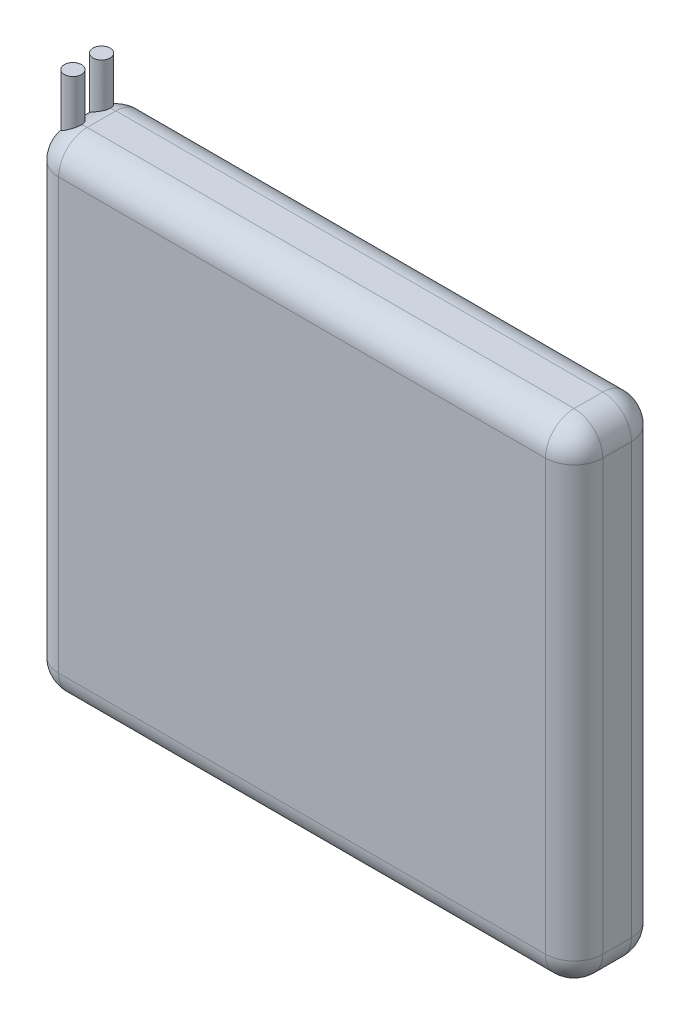
ISO-10303-21;
HEADER;
FILE_DESCRIPTION(('STEP AP214'),'2;1');
FILE_NAME('part.step','',(''),(''),'','','');
FILE_SCHEMA(('AUTOMOTIVE_DESIGN { 1 0 10303 214 1 1 1 1 }'));
ENDSEC;
DATA;
#1=APPLICATION_CONTEXT('core data for automotive mechanical design processes');
#2=APPLICATION_PROTOCOL_DEFINITION('international standard','automotive_design',2000,#1);
#3=PRODUCT_CONTEXT('',#1,'mechanical');
#4=PRODUCT('Part','Part','',(#3));
#5=PRODUCT_RELATED_PRODUCT_CATEGORY('part','',(#4));
#6=PRODUCT_DEFINITION_FORMATION('','',#4);
#7=PRODUCT_DEFINITION_CONTEXT('part definition',#1,'design');
#8=PRODUCT_DEFINITION('design','',#6,#7);
#9=PRODUCT_DEFINITION_SHAPE('','',#8);
#10=(LENGTH_UNIT() NAMED_UNIT(*) SI_UNIT(.MILLI.,.METRE.));
#11=(NAMED_UNIT(*) PLANE_ANGLE_UNIT() SI_UNIT($,.RADIAN.));
#12=(NAMED_UNIT(*) SI_UNIT($,.STERADIAN.) SOLID_ANGLE_UNIT());
#13=UNCERTAINTY_MEASURE_WITH_UNIT(LENGTH_MEASURE(1.E-05),#10,'distance_accuracy_value','');
#14=(GEOMETRIC_REPRESENTATION_CONTEXT(3) GLOBAL_UNCERTAINTY_ASSIGNED_CONTEXT((#13)) GLOBAL_UNIT_ASSIGNED_CONTEXT((#10,
#11,#12)) REPRESENTATION_CONTEXT('',''));
#15=CARTESIAN_POINT('',(0.,0.,0.));
#16=DIRECTION('',(0.,0.,1.));
#17=DIRECTION('',(1.,0.,0.));
#18=AXIS2_PLACEMENT_3D('',#15,#16,#17);
#19=CARTESIAN_POINT('',(0.,0.,6.));
#20=DIRECTION('',(1.,0.,0.));
#21=DIRECTION('',(0.,0.,-1.));
#22=AXIS2_PLACEMENT_3D('',#19,#20,#21);
#23=PLANE('',#22);
#24=DIRECTION('',(0.,-1.,0.));
#25=VECTOR('',#24,1.);
#26=CARTESIAN_POINT('',(0.,0.,4.));
#27=LINE('',#26,#25);
#28=CARTESIAN_POINT('',(0.,2.,4.));
#29=VERTEX_POINT('',#28);
#30=CARTESIAN_POINT('',(0.,32.,4.));
#31=VERTEX_POINT('',#30);
#32=EDGE_CURVE('E385',#29,#31,#27,.F.);
#33=ORIENTED_EDGE('',*,*,#32,.T.);
#34=DIRECTION('',(0.,0.,-1.));
#35=VECTOR('',#34,1.);
#36=CARTESIAN_POINT('',(0.,32.,6.));
#37=LINE('',#36,#35);
#38=CARTESIAN_POINT('',(0.,32.,2.));
#39=VERTEX_POINT('',#38);
#40=EDGE_CURVE('E387',#31,#39,#37,.T.);
#41=ORIENTED_EDGE('',*,*,#40,.T.);
#42=DIRECTION('',(0.,-1.,0.));
#43=VECTOR('',#42,1.);
#44=CARTESIAN_POINT('',(0.,0.,2.));
#45=LINE('',#44,#43);
#46=CARTESIAN_POINT('',(0.,2.,2.));
#47=VERTEX_POINT('',#46);
#48=EDGE_CURVE('E383',#39,#47,#45,.T.);
#49=ORIENTED_EDGE('',*,*,#48,.T.);
#50=DIRECTION('',(0.,0.,-1.));
#51=VECTOR('',#50,1.);
#52=CARTESIAN_POINT('',(0.,2.,6.));
#53=LINE('',#52,#51);
#54=EDGE_CURVE('E381',#47,#29,#53,.F.);
#55=ORIENTED_EDGE('',*,*,#54,.T.);
#56=EDGE_LOOP('',(#33,#41,#49,#55));
#57=FACE_BOUND('',#56,.T.);
#58=ADVANCED_FACE('F35',(#57),#23,.F.);
#59=CARTESIAN_POINT('',(0.,0.,6.));
#60=DIRECTION('',(0.,1.,0.));
#61=DIRECTION('',(0.,0.,1.));
#62=AXIS2_PLACEMENT_3D('',#59,#60,#61);
#63=PLANE('',#62);
#64=DIRECTION('',(1.,0.,0.));
#65=VECTOR('',#64,1.);
#66=CARTESIAN_POINT('',(0.,0.,4.));
#67=LINE('',#66,#65);
#68=CARTESIAN_POINT('',(36.,0.,4.));
#69=VERTEX_POINT('',#68);
#70=CARTESIAN_POINT('',(2.,0.,4.));
#71=VERTEX_POINT('',#70);
#72=EDGE_CURVE('E403',#69,#71,#67,.F.);
#73=ORIENTED_EDGE('',*,*,#72,.T.);
#74=DIRECTION('',(0.,0.,-1.));
#75=VECTOR('',#74,1.);
#76=CARTESIAN_POINT('',(2.,0.,6.));
#77=LINE('',#76,#75);
#78=CARTESIAN_POINT('',(2.,0.,2.));
#79=VERTEX_POINT('',#78);
#80=EDGE_CURVE('E405',#71,#79,#77,.T.);
#81=ORIENTED_EDGE('',*,*,#80,.T.);
#82=DIRECTION('',(1.,0.,0.));
#83=VECTOR('',#82,1.);
#84=CARTESIAN_POINT('',(38.,0.,2.));
#85=LINE('',#84,#83);
#86=CARTESIAN_POINT('',(36.,0.,2.));
#87=VERTEX_POINT('',#86);
#88=EDGE_CURVE('E399',#79,#87,#85,.T.);
#89=ORIENTED_EDGE('',*,*,#88,.T.);
#90=DIRECTION('',(0.,0.,-1.));
#91=VECTOR('',#90,1.);
#92=CARTESIAN_POINT('',(36.,0.,6.));
#93=LINE('',#92,#91);
#94=EDGE_CURVE('E401',#87,#69,#93,.F.);
#95=ORIENTED_EDGE('',*,*,#94,.T.);
#96=EDGE_LOOP('',(#73,#81,#89,#95));
#97=FACE_BOUND('',#96,.T.);
#98=ADVANCED_FACE('F262',(#97),#63,.F.);
#99=CARTESIAN_POINT('',(38.,0.,6.));
#100=DIRECTION('',(-1.,0.,0.));
#101=DIRECTION('',(0.,0.,1.));
#102=AXIS2_PLACEMENT_3D('',#99,#100,#101);
#103=PLANE('',#102);
#104=DIRECTION('',(0.,0.,-1.));
#105=VECTOR('',#104,1.);
#106=CARTESIAN_POINT('',(38.,32.,6.));
#107=LINE('',#106,#105);
#108=CARTESIAN_POINT('',(38.,32.,2.));
#109=VERTEX_POINT('',#108);
#110=CARTESIAN_POINT('',(38.,32.,4.));
#111=VERTEX_POINT('',#110);
#112=EDGE_CURVE('E394',#109,#111,#107,.F.);
#113=ORIENTED_EDGE('',*,*,#112,.T.);
#114=DIRECTION('',(0.,1.,0.));
#115=VECTOR('',#114,1.);
#116=CARTESIAN_POINT('',(38.,0.,4.));
#117=LINE('',#116,#115);
#118=CARTESIAN_POINT('',(38.,2.,4.));
#119=VERTEX_POINT('',#118);
#120=EDGE_CURVE('E396',#111,#119,#117,.F.);
#121=ORIENTED_EDGE('',*,*,#120,.T.);
#122=DIRECTION('',(0.,0.,-1.));
#123=VECTOR('',#122,1.);
#124=CARTESIAN_POINT('',(38.,2.,6.));
#125=LINE('',#124,#123);
#126=CARTESIAN_POINT('',(38.,2.,2.));
#127=VERTEX_POINT('',#126);
#128=EDGE_CURVE('E390',#119,#127,#125,.T.);
#129=ORIENTED_EDGE('',*,*,#128,.T.);
#130=DIRECTION('',(0.,1.,0.));
#131=VECTOR('',#130,1.);
#132=CARTESIAN_POINT('',(38.,34.,2.));
#133=LINE('',#132,#131);
#134=EDGE_CURVE('E392',#127,#109,#133,.T.);
#135=ORIENTED_EDGE('',*,*,#134,.T.);
#136=EDGE_LOOP('',(#113,#121,#129,#135));
#137=FACE_BOUND('',#136,.T.);
#138=ADVANCED_FACE('F268',(#137),#103,.F.);
#139=CARTESIAN_POINT('',(0.,34.,6.));
#140=DIRECTION('',(0.,-1.,0.));
#141=DIRECTION('',(0.,0.,-1.));
#142=AXIS2_PLACEMENT_3D('',#139,#140,#141);
#143=PLANE('',#142);
#144=DIRECTION('',(-1.,0.,0.));
#145=VECTOR('',#144,1.);
#146=CARTESIAN_POINT('',(0.,34.,2.));
#147=LINE('',#146,#145);
#148=CARTESIAN_POINT('',(36.,34.,2.));
#149=VERTEX_POINT('',#148);
#150=CARTESIAN_POINT('',(2.,34.,2.));
#151=VERTEX_POINT('',#150);
#152=EDGE_CURVE('E365',#149,#151,#147,.T.);
#153=ORIENTED_EDGE('',*,*,#152,.T.);
#154=DIRECTION('',(0.,0.,-1.));
#155=VECTOR('',#154,1.);
#156=CARTESIAN_POINT('',(2.,34.,6.));
#157=LINE('',#156,#155);
#158=CARTESIAN_POINT('',(2.,34.,4.));
#159=VERTEX_POINT('',#158);
#160=EDGE_CURVE('E370',#151,#159,#157,.F.);
#161=ORIENTED_EDGE('',*,*,#160,.T.);
#162=DIRECTION('',(-1.,0.,0.));
#163=VECTOR('',#162,1.);
#164=CARTESIAN_POINT('',(0.,34.,4.));
#165=LINE('',#164,#163);
#166=CARTESIAN_POINT('',(36.,34.,4.));
#167=VERTEX_POINT('',#166);
#168=EDGE_CURVE('E367',#159,#167,#165,.F.);
#169=ORIENTED_EDGE('',*,*,#168,.T.);
#170=DIRECTION('',(0.,0.,-1.));
#171=VECTOR('',#170,1.);
#172=CARTESIAN_POINT('',(36.,34.,6.));
#173=LINE('',#172,#171);
#174=EDGE_CURVE('E363',#167,#149,#173,.T.);
#175=ORIENTED_EDGE('',*,*,#174,.T.);
#176=EDGE_LOOP('',(#153,#161,#169,#175));
#177=FACE_BOUND('',#176,.T.);
#178=ADVANCED_FACE('F417',(#177),#143,.F.);
#179=CARTESIAN_POINT('',(0.,0.,6.));
#180=DIRECTION('',(0.,0.,-1.));
#181=DIRECTION('',(-1.,0.,0.));
#182=AXIS2_PLACEMENT_3D('',#179,#180,#181);
#183=PLANE('',#182);
#184=DIRECTION('',(0.,1.,0.));
#185=VECTOR('',#184,1.);
#186=CARTESIAN_POINT('',(36.,0.,6.));
#187=LINE('',#186,#185);
#188=CARTESIAN_POINT('',(36.,2.,6.));
#189=VERTEX_POINT('',#188);
#190=CARTESIAN_POINT('',(36.,32.,6.));
#191=VERTEX_POINT('',#190);
#192=EDGE_CURVE('E353',#189,#191,#187,.T.);
#193=ORIENTED_EDGE('',*,*,#192,.T.);
#194=DIRECTION('',(-1.,0.,0.));
#195=VECTOR('',#194,1.);
#196=CARTESIAN_POINT('',(0.,32.,6.));
#197=LINE('',#196,#195);
#198=CARTESIAN_POINT('',(2.,32.,6.));
#199=VERTEX_POINT('',#198);
#200=EDGE_CURVE('E359',#191,#199,#197,.T.);
#201=ORIENTED_EDGE('',*,*,#200,.T.);
#202=DIRECTION('',(0.,-1.,0.));
#203=VECTOR('',#202,1.);
#204=CARTESIAN_POINT('',(2.,0.,6.));
#205=LINE('',#204,#203);
#206=CARTESIAN_POINT('',(2.,2.,6.));
#207=VERTEX_POINT('',#206);
#208=EDGE_CURVE('E357',#199,#207,#205,.T.);
#209=ORIENTED_EDGE('',*,*,#208,.T.);
#210=DIRECTION('',(1.,0.,0.));
#211=VECTOR('',#210,1.);
#212=CARTESIAN_POINT('',(0.,2.,6.));
#213=LINE('',#212,#211);
#214=EDGE_CURVE('E203',#207,#189,#213,.T.);
#215=ORIENTED_EDGE('',*,*,#214,.T.);
#216=EDGE_LOOP('',(#193,#201,#209,#215));
#217=FACE_BOUND('',#216,.T.);
#218=ADVANCED_FACE('F187',(#217),#183,.F.);
#219=CARTESIAN_POINT('',(0.,0.,0.));
#220=DIRECTION('',(0.,0.,-1.));
#221=DIRECTION('',(-1.,0.,0.));
#222=AXIS2_PLACEMENT_3D('',#219,#220,#221);
#223=PLANE('',#222);
#224=DIRECTION('',(0.,-1.,0.));
#225=VECTOR('',#224,1.);
#226=CARTESIAN_POINT('',(2.,34.,0.));
#227=LINE('',#226,#225);
#228=CARTESIAN_POINT('',(2.,2.,0.));
#229=VERTEX_POINT('',#228);
#230=CARTESIAN_POINT('',(2.,32.,0.));
#231=VERTEX_POINT('',#230);
#232=EDGE_CURVE('E376',#229,#231,#227,.F.);
#233=ORIENTED_EDGE('',*,*,#232,.T.);
#234=DIRECTION('',(-1.,0.,0.));
#235=VECTOR('',#234,1.);
#236=CARTESIAN_POINT('',(38.,32.,0.));
#237=LINE('',#236,#235);
#238=CARTESIAN_POINT('',(36.,32.,0.));
#239=VERTEX_POINT('',#238);
#240=EDGE_CURVE('E378',#231,#239,#237,.F.);
#241=ORIENTED_EDGE('',*,*,#240,.T.);
#242=DIRECTION('',(0.,1.,0.));
#243=VECTOR('',#242,1.);
#244=CARTESIAN_POINT('',(36.,0.,0.));
#245=LINE('',#244,#243);
#246=CARTESIAN_POINT('',(36.,2.,0.));
#247=VERTEX_POINT('',#246);
#248=EDGE_CURVE('E374',#239,#247,#245,.F.);
#249=ORIENTED_EDGE('',*,*,#248,.T.);
#250=DIRECTION('',(1.,0.,0.));
#251=VECTOR('',#250,1.);
#252=CARTESIAN_POINT('',(0.,2.,0.));
#253=LINE('',#252,#251);
#254=EDGE_CURVE('E372',#247,#229,#253,.F.);
#255=ORIENTED_EDGE('',*,*,#254,.T.);
#256=EDGE_LOOP('',(#233,#241,#249,#255));
#257=FACE_BOUND('',#256,.T.);
#258=ADVANCED_FACE('F258',(#257),#223,.T.);
#259=CARTESIAN_POINT('',(0.,2.,2.));
#260=DIRECTION('',(-1.,0.,0.));
#261=DIRECTION('',(0.,0.,1.));
#262=AXIS2_PLACEMENT_3D('',#259,#260,#261);
#263=CYLINDRICAL_SURFACE('',#262,2.);
#264=CARTESIAN_POINT('',(36.,2.,2.));
#265=DIRECTION('',(1.,0.,0.));
#266=DIRECTION('',(0.,0.,-1.));
#267=AXIS2_PLACEMENT_3D('',#264,#265,#266);
#268=CIRCLE('',#267,2.);
#269=EDGE_CURVE('E349',#87,#247,#268,.T.);
#270=ORIENTED_EDGE('',*,*,#269,.F.);
#271=ORIENTED_EDGE('',*,*,#88,.F.);
#272=CARTESIAN_POINT('',(2.,2.,2.));
#273=DIRECTION('',(-1.,0.,0.));
#274=DIRECTION('',(0.,0.,1.));
#275=AXIS2_PLACEMENT_3D('',#272,#273,#274);
#276=CIRCLE('',#275,2.);
#277=EDGE_CURVE('E347',#229,#79,#276,.T.);
#278=ORIENTED_EDGE('',*,*,#277,.F.);
#279=ORIENTED_EDGE('',*,*,#254,.F.);
#280=EDGE_LOOP('',(#270,#271,#278,#279));
#281=FACE_BOUND('',#280,.T.);
#282=ADVANCED_FACE('F37',(#281),#263,.T.);
#283=CARTESIAN_POINT('',(36.,2.,2.));
#284=DIRECTION('',(0.,0.,1.));
#285=DIRECTION('',(1.,0.,0.));
#286=AXIS2_PLACEMENT_3D('',#283,#284,#285);
#287=SPHERICAL_SURFACE('',#286,2.);
#288=CARTESIAN_POINT('',(36.,2.,2.));
#289=DIRECTION('',(0.,0.,-1.));
#290=DIRECTION('',(-1.,0.,0.));
#291=AXIS2_PLACEMENT_3D('',#288,#289,#290);
#292=CIRCLE('',#291,2.);
#293=EDGE_CURVE('E341',#87,#127,#292,.F.);
#294=ORIENTED_EDGE('',*,*,#293,.F.);
#295=ORIENTED_EDGE('',*,*,#269,.T.);
#296=CARTESIAN_POINT('',(36.,2.,2.));
#297=DIRECTION('',(0.,-1.,0.));
#298=DIRECTION('',(0.,0.,-1.));
#299=AXIS2_PLACEMENT_3D('',#296,#297,#298);
#300=CIRCLE('',#299,2.);
#301=EDGE_CURVE('E344',#127,#247,#300,.F.);
#302=ORIENTED_EDGE('',*,*,#301,.F.);
#303=EDGE_LOOP('',(#294,#295,#302));
#304=FACE_BOUND('',#303,.T.);
#305=ADVANCED_FACE('F251',(#304),#287,.T.);
#306=CARTESIAN_POINT('',(2.,2.,2.));
#307=DIRECTION('',(0.,0.,1.));
#308=DIRECTION('',(1.,0.,0.));
#309=AXIS2_PLACEMENT_3D('',#306,#307,#308);
#310=SPHERICAL_SURFACE('',#309,2.);
#311=CARTESIAN_POINT('',(2.,2.,2.));
#312=DIRECTION('',(0.,-1.,0.));
#313=DIRECTION('',(0.,0.,-1.));
#314=AXIS2_PLACEMENT_3D('',#311,#312,#313);
#315=CIRCLE('',#314,2.);
#316=EDGE_CURVE('E336',#229,#47,#315,.F.);
#317=ORIENTED_EDGE('',*,*,#316,.F.);
#318=ORIENTED_EDGE('',*,*,#277,.T.);
#319=CARTESIAN_POINT('',(2.,2.,2.));
#320=DIRECTION('',(0.,0.,-1.));
#321=DIRECTION('',(-1.,0.,0.));
#322=AXIS2_PLACEMENT_3D('',#319,#320,#321);
#323=CIRCLE('',#322,2.);
#324=EDGE_CURVE('E339',#47,#79,#323,.F.);
#325=ORIENTED_EDGE('',*,*,#324,.F.);
#326=EDGE_LOOP('',(#317,#318,#325));
#327=FACE_BOUND('',#326,.T.);
#328=ADVANCED_FACE('F248',(#327),#310,.T.);
#329=CARTESIAN_POINT('',(36.,0.,2.));
#330=DIRECTION('',(0.,-1.,0.));
#331=DIRECTION('',(0.,0.,-1.));
#332=AXIS2_PLACEMENT_3D('',#329,#330,#331);
#333=CYLINDRICAL_SURFACE('',#332,2.);
#334=ORIENTED_EDGE('',*,*,#301,.T.);
#335=ORIENTED_EDGE('',*,*,#248,.F.);
#336=CARTESIAN_POINT('',(36.,32.,2.));
#337=DIRECTION('',(0.,1.,0.));
#338=DIRECTION('',(0.,0.,1.));
#339=AXIS2_PLACEMENT_3D('',#336,#337,#338);
#340=CIRCLE('',#339,2.);
#341=EDGE_CURVE('E331',#109,#239,#340,.T.);
#342=ORIENTED_EDGE('',*,*,#341,.F.);
#343=ORIENTED_EDGE('',*,*,#134,.F.);
#344=EDGE_LOOP('',(#334,#335,#342,#343));
#345=FACE_BOUND('',#344,.T.);
#346=ADVANCED_FACE('F244',(#345),#333,.T.);
#347=CARTESIAN_POINT('',(36.,2.,6.));
#348=DIRECTION('',(0.,0.,-1.));
#349=DIRECTION('',(-1.,0.,0.));
#350=AXIS2_PLACEMENT_3D('',#347,#348,#349);
#351=CYLINDRICAL_SURFACE('',#350,2.);
#352=ORIENTED_EDGE('',*,*,#293,.T.);
#353=ORIENTED_EDGE('',*,*,#128,.F.);
#354=CARTESIAN_POINT('',(36.,2.,4.));
#355=DIRECTION('',(0.,0.,1.));
#356=DIRECTION('',(1.,0.,0.));
#357=AXIS2_PLACEMENT_3D('',#354,#355,#356);
#358=CIRCLE('',#357,2.);
#359=EDGE_CURVE('E328',#69,#119,#358,.T.);
#360=ORIENTED_EDGE('',*,*,#359,.F.);
#361=ORIENTED_EDGE('',*,*,#94,.F.);
#362=EDGE_LOOP('',(#352,#353,#360,#361));
#363=FACE_BOUND('',#362,.T.);
#364=ADVANCED_FACE('F240',(#363),#351,.T.);
#365=CARTESIAN_POINT('',(0.,2.,4.));
#366=DIRECTION('',(1.,0.,0.));
#367=DIRECTION('',(0.,0.,-1.));
#368=AXIS2_PLACEMENT_3D('',#365,#366,#367);
#369=CYLINDRICAL_SURFACE('',#368,2.);
#370=CARTESIAN_POINT('',(2.,2.,4.));
#371=DIRECTION('',(-1.,0.,0.));
#372=DIRECTION('',(0.,0.,1.));
#373=AXIS2_PLACEMENT_3D('',#370,#371,#372);
#374=CIRCLE('',#373,2.);
#375=EDGE_CURVE('E322',#71,#207,#374,.T.);
#376=ORIENTED_EDGE('',*,*,#375,.F.);
#377=ORIENTED_EDGE('',*,*,#72,.F.);
#378=CARTESIAN_POINT('',(36.,2.,4.));
#379=DIRECTION('',(1.,0.,0.));
#380=DIRECTION('',(0.,0.,-1.));
#381=AXIS2_PLACEMENT_3D('',#378,#379,#380);
#382=CIRCLE('',#381,2.);
#383=EDGE_CURVE('E325',#189,#69,#382,.T.);
#384=ORIENTED_EDGE('',*,*,#383,.F.);
#385=ORIENTED_EDGE('',*,*,#214,.F.);
#386=EDGE_LOOP('',(#376,#377,#384,#385));
#387=FACE_BOUND('',#386,.T.);
#388=ADVANCED_FACE('F236',(#387),#369,.T.);
#389=CARTESIAN_POINT('',(2.,2.,6.));
#390=DIRECTION('',(0.,0.,-1.));
#391=DIRECTION('',(-1.,0.,0.));
#392=AXIS2_PLACEMENT_3D('',#389,#390,#391);
#393=CYLINDRICAL_SURFACE('',#392,2.);
#394=ORIENTED_EDGE('',*,*,#324,.T.);
#395=ORIENTED_EDGE('',*,*,#80,.F.);
#396=CARTESIAN_POINT('',(2.,2.,4.));
#397=DIRECTION('',(0.,0.,1.));
#398=DIRECTION('',(1.,0.,0.));
#399=AXIS2_PLACEMENT_3D('',#396,#397,#398);
#400=CIRCLE('',#399,2.);
#401=EDGE_CURVE('E319',#29,#71,#400,.T.);
#402=ORIENTED_EDGE('',*,*,#401,.F.);
#403=ORIENTED_EDGE('',*,*,#54,.F.);
#404=EDGE_LOOP('',(#394,#395,#402,#403));
#405=FACE_BOUND('',#404,.T.);
#406=ADVANCED_FACE('F232',(#405),#393,.T.);
#407=CARTESIAN_POINT('',(2.,0.,2.));
#408=DIRECTION('',(0.,1.,0.));
#409=DIRECTION('',(0.,0.,1.));
#410=AXIS2_PLACEMENT_3D('',#407,#408,#409);
#411=CYLINDRICAL_SURFACE('',#410,2.);
#412=ORIENTED_EDGE('',*,*,#316,.T.);
#413=ORIENTED_EDGE('',*,*,#48,.F.);
#414=CARTESIAN_POINT('',(2.,32.,2.));
#415=DIRECTION('',(0.,1.,0.));
#416=DIRECTION('',(0.,0.,1.));
#417=AXIS2_PLACEMENT_3D('',#414,#415,#416);
#418=CIRCLE('',#417,2.);
#419=EDGE_CURVE('E316',#231,#39,#418,.T.);
#420=ORIENTED_EDGE('',*,*,#419,.F.);
#421=ORIENTED_EDGE('',*,*,#232,.F.);
#422=EDGE_LOOP('',(#412,#413,#420,#421));
#423=FACE_BOUND('',#422,.T.);
#424=ADVANCED_FACE('F228',(#423),#411,.T.);
#425=CARTESIAN_POINT('',(0.,32.,2.));
#426=DIRECTION('',(1.,0.,0.));
#427=DIRECTION('',(0.,0.,-1.));
#428=AXIS2_PLACEMENT_3D('',#425,#426,#427);
#429=CYLINDRICAL_SURFACE('',#428,2.);
#430=CARTESIAN_POINT('',(36.,32.,2.));
#431=DIRECTION('',(1.,0.,0.));
#432=DIRECTION('',(0.,0.,-1.));
#433=AXIS2_PLACEMENT_3D('',#430,#431,#432);
#434=CIRCLE('',#433,2.);
#435=EDGE_CURVE('E333',#239,#149,#434,.T.);
#436=ORIENTED_EDGE('',*,*,#435,.F.);
#437=ORIENTED_EDGE('',*,*,#240,.F.);
#438=CARTESIAN_POINT('',(2.,32.,2.));
#439=DIRECTION('',(-1.,0.,0.));
#440=DIRECTION('',(0.,0.,1.));
#441=AXIS2_PLACEMENT_3D('',#438,#439,#440);
#442=CIRCLE('',#441,2.);
#443=EDGE_CURVE('E313',#151,#231,#442,.T.);
#444=ORIENTED_EDGE('',*,*,#443,.F.);
#445=ORIENTED_EDGE('',*,*,#152,.F.);
#446=EDGE_LOOP('',(#436,#437,#444,#445));
#447=FACE_BOUND('',#446,.T.);
#448=ADVANCED_FACE('F224',(#447),#429,.T.);
#449=CARTESIAN_POINT('',(36.,32.,2.));
#450=DIRECTION('',(0.,0.,1.));
#451=DIRECTION('',(1.,0.,0.));
#452=AXIS2_PLACEMENT_3D('',#449,#450,#451);
#453=SPHERICAL_SURFACE('',#452,2.);
#454=ORIENTED_EDGE('',*,*,#341,.T.);
#455=ORIENTED_EDGE('',*,*,#435,.T.);
#456=CARTESIAN_POINT('',(36.,32.,2.));
#457=DIRECTION('',(0.,0.,-1.));
#458=DIRECTION('',(-1.,0.,0.));
#459=AXIS2_PLACEMENT_3D('',#456,#457,#458);
#460=CIRCLE('',#459,2.);
#461=EDGE_CURVE('E310',#109,#149,#460,.F.);
#462=ORIENTED_EDGE('',*,*,#461,.F.);
#463=EDGE_LOOP('',(#454,#455,#462));
#464=FACE_BOUND('',#463,.T.);
#465=ADVANCED_FACE('F220',(#464),#453,.T.);
#466=CARTESIAN_POINT('',(36.,2.,4.));
#467=DIRECTION('',(0.,0.,1.));
#468=DIRECTION('',(1.,0.,0.));
#469=AXIS2_PLACEMENT_3D('',#466,#467,#468);
#470=SPHERICAL_SURFACE('',#469,2.);
#471=ORIENTED_EDGE('',*,*,#383,.T.);
#472=ORIENTED_EDGE('',*,*,#359,.T.);
#473=CARTESIAN_POINT('',(36.,2.,4.));
#474=DIRECTION('',(0.,-1.,0.));
#475=DIRECTION('',(0.,0.,-1.));
#476=AXIS2_PLACEMENT_3D('',#473,#474,#475);
#477=CIRCLE('',#476,2.);
#478=EDGE_CURVE('E308',#189,#119,#477,.F.);
#479=ORIENTED_EDGE('',*,*,#478,.F.);
#480=EDGE_LOOP('',(#471,#472,#479));
#481=FACE_BOUND('',#480,.T.);
#482=ADVANCED_FACE('F216',(#481),#470,.T.);
#483=CARTESIAN_POINT('',(2.,2.,4.));
#484=DIRECTION('',(0.,0.,1.));
#485=DIRECTION('',(1.,0.,0.));
#486=AXIS2_PLACEMENT_3D('',#483,#484,#485);
#487=SPHERICAL_SURFACE('',#486,2.);
#488=ORIENTED_EDGE('',*,*,#401,.T.);
#489=ORIENTED_EDGE('',*,*,#375,.T.);
#490=CARTESIAN_POINT('',(2.,2.,4.));
#491=DIRECTION('',(0.,-1.,0.));
#492=DIRECTION('',(0.,0.,-1.));
#493=AXIS2_PLACEMENT_3D('',#490,#491,#492);
#494=CIRCLE('',#493,2.);
#495=EDGE_CURVE('E305',#29,#207,#494,.F.);
#496=ORIENTED_EDGE('',*,*,#495,.F.);
#497=EDGE_LOOP('',(#488,#489,#496));
#498=FACE_BOUND('',#497,.T.);
#499=ADVANCED_FACE('F211',(#498),#487,.T.);
#500=CARTESIAN_POINT('',(2.,32.,2.));
#501=DIRECTION('',(0.,0.,1.));
#502=DIRECTION('',(1.,0.,0.));
#503=AXIS2_PLACEMENT_3D('',#500,#501,#502);
#504=SPHERICAL_SURFACE('',#503,2.);
#505=CARTESIAN_POINT('',(1.59999996666667,33.9595917772162,2.0002));
#506=CARTESIAN_POINT('',(1.60004877027794,33.9596121920382,1.96918999798493));
#507=CARTESIAN_POINT('',(1.59761925622541,33.9583768328417,1.93820600324784));
#508=CARTESIAN_POINT('',(1.58810695821391,33.9535159093271,1.87725824784497));
#509=CARTESIAN_POINT('',(1.58104011159057,33.949898531256,1.84729136129106));
#510=CARTESIAN_POINT('',(1.56255718132155,33.9403956957948,1.78913577353399));
#511=CARTESIAN_POINT('',(1.55114312438775,33.9345112952979,1.76094625083368));
#512=CARTESIAN_POINT('',(1.52445979476335,33.9206685548261,1.70700266129054));
#513=CARTESIAN_POINT('',(1.50918852133269,33.9127091384704,1.68124986793915));
#514=CARTESIAN_POINT('',(1.47471051384159,33.8945991279862,1.63176829969326));
#515=CARTESIAN_POINT('',(1.45537370075598,33.8843752850945,1.6081573725964));
#516=CARTESIAN_POINT('',(1.41385116350457,33.8622097543142,1.56452881996435));
#517=CARTESIAN_POINT('',(1.3916644242985,33.8502674541903,1.54451248081171));
#518=CARTESIAN_POINT('',(1.34273637664914,33.8236412003869,1.50645408631195));
#519=CARTESIAN_POINT('',(1.31576133213929,33.8088018365291,1.48882184072732));
#520=CARTESIAN_POINT('',(1.26000168248885,33.7777078957151,1.45832634061985));
#521=CARTESIAN_POINT('',(1.23121632773173,33.761452731415,1.44546507708395));
#522=CARTESIAN_POINT('',(1.1690015498484,33.7257919624347,1.42323481838488));
#523=CARTESIAN_POINT('',(1.13543357686228,33.7062438038973,1.41448214932335));
#524=CARTESIAN_POINT('',(1.06786725852449,33.6661742220957,1.40286457450871));
#525=CARTESIAN_POINT('',(1.03386872323843,33.645652357499,1.4000023651986));
#526=CARTESIAN_POINT('',(0.96240051331712,33.6016668868635,1.3999973712254));
#527=CARTESIAN_POINT('',(0.924973161726296,33.5781330827549,1.40353808522173));
#528=CARTESIAN_POINT('',(0.851509201989394,33.530874710171,1.41746239468171));
#529=CARTESIAN_POINT('',(0.815473691363291,33.5071500082853,1.42785127810268));
#530=CARTESIAN_POINT('',(0.743490711624681,33.4586314612412,1.45613199136651));
#531=CARTESIAN_POINT('',(0.707693897189347,33.4338652893594,1.4744580492275));
#532=CARTESIAN_POINT('',(0.639833087896474,33.385728288653,1.51842777208106));
#533=CARTESIAN_POINT('',(0.607766080342769,33.3623563412037,1.54406547259796));
#534=CARTESIAN_POINT('',(0.555984860407171,33.3237248017604,1.59524165519093));
#535=CARTESIAN_POINT('',(0.535175830582805,33.3078873048461,1.61924070504813));
#536=CARTESIAN_POINT('',(0.497125734317802,33.2784626859984,1.67113985598298));
#537=CARTESIAN_POINT('',(0.479879896439126,33.2648725595671,1.69903465524634));
#538=CARTESIAN_POINT('',(0.452535918819091,33.2430484039239,1.75296882061883));
#539=CARTESIAN_POINT('',(0.441708491885895,33.2342898864031,1.77842512714337));
#540=CARTESIAN_POINT('',(0.423538395307254,33.2194801817332,1.83127321165658));
#541=CARTESIAN_POINT('',(0.416188357344786,33.2134232716615,1.85866075462555));
#542=CARTESIAN_POINT('',(0.407236368615786,33.2060189812888,1.90519653883567));
#543=CARTESIAN_POINT('',(0.404530968446758,33.2037715138689,1.9239969127831));
#544=CARTESIAN_POINT('',(0.400903687313997,33.20075309943,1.96192570115608));
#545=CARTESIAN_POINT('',(0.399985657528423,33.1999853407183,1.98105473452925));
#546=CARTESIAN_POINT('',(0.400000033333335,33.2000000277778,2.0002));
#547=B_SPLINE_CURVE_WITH_KNOTS('',3,(#505,#506,#507,#508,#509,#510,#511,#512,#513,#514,#515,
#516,#517,#518,#519,#520,#521,#522,#523,#524,#525,#526,#527,#528,#529,#530,#531,#532,#533,#534,
#535,#536,#537,#538,#539,#540,#541,#542,#543,#544,#545,#546),.UNSPECIFIED.,.F.,.F.,(4,2,2,2,2,2,
2,2,2,2,2,2,2,2,2,2,2,2,2,2,4),(0.,0.0928672780727597,0.185417054736968,0.277923736503819,
0.370478500425421,0.466636955245479,0.562829753675301,0.668837120400247,0.774888675612968,
0.893859997436049,1.01288576799642,1.14537371712708,1.27796408962751,1.41896712186995,
1.55985545823241,1.66594652041079,1.77189458284658,1.85860150507129,1.94512386997494,
2.0023689610318,2.05973725997394),.UNSPECIFIED.);
#548=CARTESIAN_POINT('',(1.6,33.9595917942265,2.));
#549=VERTEX_POINT('',#548);
#550=CARTESIAN_POINT('',(0.4,33.2,2.));
#551=VERTEX_POINT('',#550);
#552=EDGE_CURVE('E195',#549,#551,#547,.T.);
#553=ORIENTED_EDGE('',*,*,#552,.F.);
#554=CARTESIAN_POINT('',(2.,32.,2.));
#555=DIRECTION('',(0.,0.,-1.));
#556=DIRECTION('',(-1.,0.,0.));
#557=AXIS2_PLACEMENT_3D('',#554,#555,#556);
#558=CIRCLE('',#557,2.);
#559=EDGE_CURVE('E303',#151,#549,#558,.F.);
#560=ORIENTED_EDGE('',*,*,#559,.F.);
#561=ORIENTED_EDGE('',*,*,#443,.T.);
#562=ORIENTED_EDGE('',*,*,#419,.T.);
#563=EDGE_CURVE('E299',#551,#39,#558,.F.);
#564=ORIENTED_EDGE('',*,*,#563,.F.);
#565=EDGE_LOOP('',(#553,#560,#561,#562,#564));
#566=FACE_BOUND('',#565,.T.);
#567=ADVANCED_FACE('F205',(#566),#504,.T.);
#568=CARTESIAN_POINT('',(36.,32.,6.));
#569=DIRECTION('',(0.,0.,-1.));
#570=DIRECTION('',(-1.,0.,0.));
#571=AXIS2_PLACEMENT_3D('',#568,#569,#570);
#572=CYLINDRICAL_SURFACE('',#571,2.);
#573=ORIENTED_EDGE('',*,*,#461,.T.);
#574=ORIENTED_EDGE('',*,*,#174,.F.);
#575=CARTESIAN_POINT('',(36.,32.,4.));
#576=DIRECTION('',(0.,0.,1.));
#577=DIRECTION('',(1.,0.,0.));
#578=AXIS2_PLACEMENT_3D('',#575,#576,#577);
#579=CIRCLE('',#578,2.);
#580=EDGE_CURVE('E291',#111,#167,#579,.T.);
#581=ORIENTED_EDGE('',*,*,#580,.F.);
#582=ORIENTED_EDGE('',*,*,#112,.F.);
#583=EDGE_LOOP('',(#573,#574,#581,#582));
#584=FACE_BOUND('',#583,.T.);
#585=ADVANCED_FACE('F210',(#584),#572,.T.);
#586=CARTESIAN_POINT('',(36.,0.,4.));
#587=DIRECTION('',(0.,1.,0.));
#588=DIRECTION('',(0.,0.,1.));
#589=AXIS2_PLACEMENT_3D('',#586,#587,#588);
#590=CYLINDRICAL_SURFACE('',#589,2.);
#591=ORIENTED_EDGE('',*,*,#478,.T.);
#592=ORIENTED_EDGE('',*,*,#120,.F.);
#593=CARTESIAN_POINT('',(36.,32.,4.));
#594=DIRECTION('',(0.,1.,0.));
#595=DIRECTION('',(0.,0.,1.));
#596=AXIS2_PLACEMENT_3D('',#593,#594,#595);
#597=CIRCLE('',#596,2.);
#598=EDGE_CURVE('E289',#191,#111,#597,.T.);
#599=ORIENTED_EDGE('',*,*,#598,.F.);
#600=ORIENTED_EDGE('',*,*,#192,.F.);
#601=EDGE_LOOP('',(#591,#592,#599,#600));
#602=FACE_BOUND('',#601,.T.);
#603=ADVANCED_FACE('F438',(#602),#590,.T.);
#604=CARTESIAN_POINT('',(2.,0.,4.));
#605=DIRECTION('',(0.,-1.,0.));
#606=DIRECTION('',(0.,0.,-1.));
#607=AXIS2_PLACEMENT_3D('',#604,#605,#606);
#608=CYLINDRICAL_SURFACE('',#607,2.);
#609=ORIENTED_EDGE('',*,*,#495,.T.);
#610=ORIENTED_EDGE('',*,*,#208,.F.);
#611=CARTESIAN_POINT('',(2.,32.,4.));
#612=DIRECTION('',(0.,1.,0.));
#613=DIRECTION('',(0.,0.,1.));
#614=AXIS2_PLACEMENT_3D('',#611,#612,#613);
#615=CIRCLE('',#614,2.);
#616=EDGE_CURVE('E145',#31,#199,#615,.T.);
#617=ORIENTED_EDGE('',*,*,#616,.F.);
#618=ORIENTED_EDGE('',*,*,#32,.F.);
#619=EDGE_LOOP('',(#609,#610,#617,#618));
#620=FACE_BOUND('',#619,.T.);
#621=ADVANCED_FACE('F284',(#620),#608,.T.);
#622=CARTESIAN_POINT('',(2.,32.,6.));
#623=DIRECTION('',(0.,0.,-1.));
#624=DIRECTION('',(-1.,0.,0.));
#625=AXIS2_PLACEMENT_3D('',#622,#623,#624);
#626=CYLINDRICAL_SURFACE('',#625,2.);
#627=CARTESIAN_POINT('',(1.,33.7320508075689,4.6));
#628=CARTESIAN_POINT('',(1.03257261387343,33.7508569408318,4.59999964221495));
#629=CARTESIAN_POINT('',(1.06568527031425,33.7687402430748,4.59734471202051));
#630=CARTESIAN_POINT('',(1.13209662039606,33.8022554007661,4.58624403645256));
#631=CARTESIAN_POINT('',(1.16539523963011,33.8178880978491,4.57780046263802));
#632=CARTESIAN_POINT('',(1.23118223320813,33.8466768472448,4.55477462673291));
#633=CARTESIAN_POINT('',(1.26366538877286,33.859819358931,4.54016012335479));
#634=CARTESIAN_POINT('',(1.32622752790658,33.8833875574305,4.50484052222319));
#635=CARTESIAN_POINT('',(1.35630733833218,33.8938141814435,4.48413753075207));
#636=CARTESIAN_POINT('',(1.41011743292925,33.9112217547333,4.43922779804237));
#637=CARTESIAN_POINT('',(1.43417479047836,33.9184271454855,4.41549853630524));
#638=CARTESIAN_POINT('',(1.47815202241592,33.930854221211,4.36402682365912));
#639=CARTESIAN_POINT('',(1.49807277900625,33.9360763293511,4.33628523059482));
#640=CARTESIAN_POINT('',(1.53227451499893,33.944616142889,4.27884596608676));
#641=CARTESIAN_POINT('',(1.54675527633719,33.9480039018765,4.24927729227687));
#642=CARTESIAN_POINT('',(1.57071252301859,33.9534236466255,4.18806206956799));
#643=CARTESIAN_POINT('',(1.58018921930142,33.9554556895364,4.15641560831859));
#644=CARTESIAN_POINT('',(1.59381899435008,33.9583324457087,4.09198873066703));
#645=CARTESIAN_POINT('',(1.59797900469968,33.9591787050644,4.05920984806334));
#646=CARTESIAN_POINT('',(1.60086706135798,33.9597691607922,3.9934029821085));
#647=CARTESIAN_POINT('',(1.59959495368803,33.9595133259245,3.96037499172264));
#648=CARTESIAN_POINT('',(1.59164497998844,33.957871918547,3.89489273164356));
#649=CARTESIAN_POINT('',(1.58494919784572,33.9564826016776,3.86244072825578));
#650=CARTESIAN_POINT('',(1.56634520619924,33.9524429300811,3.79914946806799));
#651=CARTESIAN_POINT('',(1.55443714028597,33.9497926100925,3.76831016686668));
#652=CARTESIAN_POINT('',(1.52583361319931,33.9430338846261,3.70918136110952));
#653=CARTESIAN_POINT('',(1.50914700445968,33.9389281720044,3.68088726766795));
#654=CARTESIAN_POINT('',(1.47156315957949,33.9290232538878,3.62758719108937));
#655=CARTESIAN_POINT('',(1.4506663667366,33.9232242266561,3.60258086223558));
#656=CARTESIAN_POINT('',(1.40548903042464,33.9097406229546,3.55658743947858));
#657=CARTESIAN_POINT('',(1.38121859726235,33.9020616299726,3.53558876564746));
#658=CARTESIAN_POINT('',(1.33013866292165,33.8846783784029,3.49798956214264));
#659=CARTESIAN_POINT('',(1.30332916386853,33.8749741215106,3.48138902878757));
#660=CARTESIAN_POINT('',(1.2475931845661,33.8533196215656,3.4525505032185));
#661=CARTESIAN_POINT('',(1.21863621179598,33.8413302966342,3.44040115644248));
#662=CARTESIAN_POINT('',(1.16002382737479,33.8153426080928,3.42090811481151));
#663=CARTESIAN_POINT('',(1.13036821162813,33.8013436511669,3.41356584275077));
#664=CARTESIAN_POINT('',(1.0689317544596,33.7704186058068,3.40309786626899));
#665=CARTESIAN_POINT('',(1.03716110478091,33.7533507738313,3.40033596388195));
#666=CARTESIAN_POINT('',(0.974570379659196,33.7174975824416,3.39972138171346));
#667=CARTESIAN_POINT('',(0.943750679395326,33.6987115564464,3.40187061504993));
#668=CARTESIAN_POINT('',(0.87927360966478,33.6570004628244,3.41124313586386));
#669=CARTESIAN_POINT('',(0.845850362311775,33.6338696972629,3.41915521858287));
#670=CARTESIAN_POINT('',(0.781516169145272,33.5864735192677,3.44016765714086));
#671=CARTESIAN_POINT('',(0.750607931237677,33.5622069270254,3.45327351829722));
#672=CARTESIAN_POINT('',(0.686542983007738,33.5089245207519,3.48689870236802));
#673=CARTESIAN_POINT('',(0.65393025395375,33.4798167932517,3.50831098591829));
#674=CARTESIAN_POINT('',(0.593128606902264,33.4221334279235,3.55730170663608));
#675=CARTESIAN_POINT('',(0.564938951440643,33.3935577020961,3.58487911402222));
#676=CARTESIAN_POINT('',(0.521149024607574,33.3467403993684,3.637366146464));
#677=CARTESIAN_POINT('',(0.504276840212548,33.3279187554208,3.66070123974483));
#678=CARTESIAN_POINT('',(0.473510961056299,33.2924311171409,3.7107430893947));
#679=CARTESIAN_POINT('',(0.459611716657989,33.2757611297662,3.73744341303833));
#680=CARTESIAN_POINT('',(0.438913996686224,33.2502802025601,3.78628845174347));
#681=CARTESIAN_POINT('',(0.431219222949606,33.240580322961,3.8075834122191));
#682=CARTESIAN_POINT('',(0.418119558743444,33.2238331744332,3.85186003099983));
#683=CARTESIAN_POINT('',(0.41271079934503,33.2167814259908,3.87483876164654));
#684=CARTESIAN_POINT('',(0.405224802140537,33.2069485485313,3.91843115631587));
#685=CARTESIAN_POINT('',(0.402763559931999,33.2036779609267,3.93886626359358));
#686=CARTESIAN_POINT('',(0.399973279338773,33.1999668298788,3.98013419884162));
#687=CARTESIAN_POINT('',(0.399642831864518,33.1995244161724,4.00096675483479));
#688=CARTESIAN_POINT('',(0.401140964124645,33.2015202898588,4.04239792979005));
#689=CARTESIAN_POINT('',(0.402968359637107,33.2039569971935,4.06299667080835));
#690=CARTESIAN_POINT('',(0.408628689477209,33.2114284025257,4.10343177879088));
#691=CARTESIAN_POINT('',(0.412463561899607,33.2164656110813,4.12326738909842));
#692=CARTESIAN_POINT('',(0.423639136513346,33.2309332635938,4.16896029986671));
#693=CARTESIAN_POINT('',(0.431752086062385,33.2412996948628,4.19432903610333));
#694=CARTESIAN_POINT('',(0.450649191892678,33.2648084855973,4.24267567069235));
#695=CARTESIAN_POINT('',(0.461440305690234,33.2779580619983,4.26564711684669));
#696=CARTESIAN_POINT('',(0.491224445024419,33.3131479157006,4.3202258654616));
#697=CARTESIAN_POINT('',(0.511607351679626,33.336324395179,4.35033554753357));
#698=CARTESIAN_POINT('',(0.556398181374592,33.3845961232823,4.40556544866163));
#699=CARTESIAN_POINT('',(0.580811762880082,33.4096940423727,4.43067854237982));
#700=CARTESIAN_POINT('',(0.634294473415383,33.4616068916456,4.4770349462165));
#701=CARTESIAN_POINT('',(0.663516373523449,33.4884496175693,4.49807072782155));
#702=CARTESIAN_POINT('',(0.725431031486415,33.5417986144196,4.53469968636415));
#703=CARTESIAN_POINT('',(0.758121195335071,33.5683051204317,4.55029689404597));
#704=CARTESIAN_POINT('',(0.824602571929821,33.6186655041668,4.57481870006704));
#705=CARTESIAN_POINT('',(0.858220493242338,33.6425841126656,4.58407730432374));
#706=CARTESIAN_POINT('',(0.927667014519503,33.6887378286351,4.5966664629944));
#707=CARTESIAN_POINT('',(0.963494340587142,33.7109738900566,4.60000040098653));
#708=CARTESIAN_POINT('',(1.,33.7320508075689,4.6));
#709=B_SPLINE_CURVE_WITH_KNOTS('',3,(#627,#628,#629,#630,#631,#632,#633,#634,#635,#636,#637,
#638,#639,#640,#641,#642,#643,#644,#645,#646,#647,#648,#649,#650,#651,#652,#653,#654,#655,#656,
#657,#658,#659,#660,#661,#662,#663,#664,#665,#666,#667,#668,#669,#670,#671,#672,#673,#674,#675,
#676,#677,#678,#679,#680,#681,#682,#683,#684,#685,#686,#687,#688,#689,#690,#691,#692,#693,#694,
#695,#696,#697,#698,#699,#700,#701,#702,#703,#704,#705,#706,#707,#708),.UNSPECIFIED.,.T.,.F.,(4,
2,2,2,2,2,2,2,2,2,2,2,2,2,2,2,2,2,2,2,2,2,2,2,2,2,2,2,2,2,2,2,2,2,2,2,2,2,2,2,4),(0.,
0.11271609971524,0.225389938094027,0.338659893948912,0.451890710624929,0.555017896877734,
0.658123066830315,0.756948345211185,0.855769457411521,0.954461600564223,1.0531565412603,
1.15217883860952,1.25119840821649,1.35003571396377,1.44886261839154,1.54739949434878,
1.6459362878274,1.74634062971055,1.84677467577377,1.95485929473342,2.06298602490364,
2.1867485037991,2.31064252123243,2.45608590647719,2.60150501595185,2.70443833285438,
2.80717779225805,2.88083624747687,2.95436953651547,3.0166128964379,3.07881509074723,
3.14098316441805,3.20321136851233,3.28847187384392,3.37395623671773,3.50261275439227,
3.63145144682256,3.76571639939168,3.89988163027444,4.02628007074222,4.15260630180676),.UNSPECIFIED.);
#710=CARTESIAN_POINT('',(1.6,33.9595917942265,4.));
#711=VERTEX_POINT('',#710);
#712=CARTESIAN_POINT('',(0.4,33.2,4.));
#713=VERTEX_POINT('',#712);
#714=EDGE_CURVE('E149',#711,#713,#709,.T.);
#715=ORIENTED_EDGE('',*,*,#714,.F.);
#716=CARTESIAN_POINT('',(2.,32.,4.));
#717=DIRECTION('',(0.,0.,1.));
#718=DIRECTION('',(1.,0.,0.));
#719=AXIS2_PLACEMENT_3D('',#716,#717,#718);
#720=CIRCLE('',#719,2.);
#721=EDGE_CURVE('E138',#159,#711,#720,.T.);
#722=ORIENTED_EDGE('',*,*,#721,.F.);
#723=ORIENTED_EDGE('',*,*,#160,.F.);
#724=ORIENTED_EDGE('',*,*,#559,.T.);
#725=CARTESIAN_POINT('',(0.4,33.2,2.));
#726=CARTESIAN_POINT('',(0.399997024276994,33.1999939555349,2.01292829285252));
#727=CARTESIAN_POINT('',(0.400418155603923,33.2005576555887,2.02584544583527));
#728=CARTESIAN_POINT('',(0.402077750893068,33.2027666202993,2.05151054471436));
#729=CARTESIAN_POINT('',(0.403314696325811,33.2044098754855,2.06425876017905));
#730=CARTESIAN_POINT('',(0.408155309224332,33.2108093100558,2.10171402069429));
#731=CARTESIAN_POINT('',(0.41289088070538,33.2170389461202,2.12603655722379));
#732=CARTESIAN_POINT('',(0.424903505059071,33.2325438121611,2.17275783700047));
#733=CARTESIAN_POINT('',(0.432162860772733,33.2417978084574,2.19516865709965));
#734=CARTESIAN_POINT('',(0.448817057382763,33.2625411772978,2.23818347039102));
#735=CARTESIAN_POINT('',(0.458221529659964,33.274040597007,2.2587787151699));
#736=CARTESIAN_POINT('',(0.485614276966352,33.3066505627107,2.31107631691607));
#737=CARTESIAN_POINT('',(0.50516821490386,33.3290908594219,2.341125250645));
#738=CARTESIAN_POINT('',(0.548213203439843,33.3759856559363,2.39637950378523));
#739=CARTESIAN_POINT('',(0.571709209293245,33.4004426708673,2.42157864022235));
#740=CARTESIAN_POINT('',(0.623218649310583,33.4511485302945,2.46828692389435));
#741=CARTESIAN_POINT('',(0.651379633291768,33.4774295631113,2.48959831205572));
#742=CARTESIAN_POINT('',(0.711106914836288,33.5298154875483,2.52705138117297));
#743=CARTESIAN_POINT('',(0.742674238713327,33.5559203235498,2.54319149820339));
#744=CARTESIAN_POINT('',(0.814991340995241,33.6118961012206,2.57232798579163));
#745=CARTESIAN_POINT('',(0.856360313731902,33.641572302696,2.58419341524192));
#746=CARTESIAN_POINT('',(0.942405275252055,33.698273070289,2.59881323704824));
#747=CARTESIAN_POINT('',(0.987075711100839,33.7253019187453,2.6015825874495));
#748=CARTESIAN_POINT('',(1.06498760301777,33.7683715871714,2.5973572826051));
#749=CARTESIAN_POINT('',(1.09785681957048,33.7853482172044,2.59292109476487));
#750=CARTESIAN_POINT('',(1.16342885551548,33.8169944238822,2.57828759714998));
#751=CARTESIAN_POINT('',(1.19613178486854,33.8316657930417,2.56809479220116));
#752=CARTESIAN_POINT('',(1.2603397354834,33.858526597045,2.54169517728415));
#753=CARTESIAN_POINT('',(1.29183796292966,33.870703278359,2.52545860367738));
#754=CARTESIAN_POINT('',(1.35208499063022,33.8924144519188,2.48714360424513));
#755=CARTESIAN_POINT('',(1.38083436821455,33.9019494997781,2.46506640878761));
#756=CARTESIAN_POINT('',(1.43189716614035,33.9177885758678,2.41781369732344));
#757=CARTESIAN_POINT('',(1.45455343124336,33.9243021057273,2.39307737885999));
#758=CARTESIAN_POINT('',(1.49557702608466,33.93546135122,2.33989745980641));
#759=CARTESIAN_POINT('',(1.5139445049249,33.9401071317907,2.31145398815101));
#760=CARTESIAN_POINT('',(1.54518308438363,33.9476633489284,2.25268237839419));
#761=CARTESIAN_POINT('',(1.55821190413259,33.9506247733603,2.22244422835353));
#762=CARTESIAN_POINT('',(1.57915697280809,33.9552512560732,2.16016790169037));
#763=CARTESIAN_POINT('',(1.58707824108419,33.9569175874142,2.12813152600918));
#764=CARTESIAN_POINT('',(1.59487933313689,33.9585410456552,2.07985357728555));
#765=CARTESIAN_POINT('',(1.59679983056027,33.9589364674235,2.06393085058625));
#766=CARTESIAN_POINT('',(1.59935892731769,33.9594610707313,2.03200781715782));
#767=CARTESIAN_POINT('',(1.5999998780415,33.9595907406479,2.01600770699841));
#768=CARTESIAN_POINT('',(1.6,33.9595917942265,2.));
#769=B_SPLINE_CURVE_WITH_KNOTS('',3,(#725,#726,#727,#728,#729,#730,#731,#732,#733,#734,#735,
#736,#737,#738,#739,#740,#741,#742,#743,#744,#745,#746,#747,#748,#749,#750,#751,#752,#753,#754,
#755,#756,#757,#758,#759,#760,#761,#762,#763,#764,#765,#766,#767,#768),.UNSPECIFIED.,.F.,.F.,(4,
2,2,2,2,2,2,2,2,2,2,2,2,2,2,2,2,2,2,2,2,4),(0.,0.0387457741019066,0.077419630870058,
0.153576151091829,0.22920907640192,0.305188515069843,0.431374943218711,0.557721195135367,
0.68933756907501,0.820993709703728,0.976962195397125,1.13267406999604,1.24399538533018,
1.35522970692214,1.46701922992707,1.57878522241048,1.68078669199989,1.78278461492567,
1.88150340839062,1.98012503937019,2.02820812876863,2.07620277548237),.UNSPECIFIED.);
#770=EDGE_CURVE('E49',#551,#549,#769,.T.);
#771=ORIENTED_EDGE('',*,*,#770,.F.);
#772=ORIENTED_EDGE('',*,*,#563,.T.);
#773=ORIENTED_EDGE('',*,*,#40,.F.);
#774=EDGE_CURVE('E146',#713,#31,#720,.T.);
#775=ORIENTED_EDGE('',*,*,#774,.F.);
#776=EDGE_LOOP('',(#715,#722,#723,#724,#771,#772,#773,#775));
#777=FACE_BOUND('',#776,.T.);
#778=ADVANCED_FACE('F150',(#777),#626,.T.);
#779=CARTESIAN_POINT('',(36.,32.,4.));
#780=DIRECTION('',(0.,0.,1.));
#781=DIRECTION('',(1.,0.,0.));
#782=AXIS2_PLACEMENT_3D('',#779,#780,#781);
#783=SPHERICAL_SURFACE('',#782,2.);
#784=ORIENTED_EDGE('',*,*,#598,.T.);
#785=ORIENTED_EDGE('',*,*,#580,.T.);
#786=CARTESIAN_POINT('',(36.,32.,4.));
#787=DIRECTION('',(1.,0.,0.));
#788=DIRECTION('',(0.,0.,-1.));
#789=AXIS2_PLACEMENT_3D('',#786,#787,#788);
#790=CIRCLE('',#789,2.);
#791=EDGE_CURVE('E293',#191,#167,#790,.F.);
#792=ORIENTED_EDGE('',*,*,#791,.F.);
#793=EDGE_LOOP('',(#784,#785,#792));
#794=FACE_BOUND('',#793,.T.);
#795=ADVANCED_FACE('F278',(#794),#783,.T.);
#796=CARTESIAN_POINT('',(2.,32.,4.));
#797=DIRECTION('',(0.,0.,1.));
#798=DIRECTION('',(1.,0.,0.));
#799=AXIS2_PLACEMENT_3D('',#796,#797,#798);
#800=SPHERICAL_SURFACE('',#799,2.);
#801=CARTESIAN_POINT('',(0.400000033333335,33.2000000277778,3.9998));
#802=CARTESIAN_POINT('',(0.399946898216753,33.199943704415,4.0284985014367));
#803=CARTESIAN_POINT('',(0.402036617008585,33.2016976767328,4.05713046822646));
#804=CARTESIAN_POINT('',(0.410117197605029,33.2084091970433,4.11322716927321));
#805=CARTESIAN_POINT('',(0.416076801375004,33.2133410738683,4.14069939363849));
#806=CARTESIAN_POINT('',(0.431503421013159,33.2259868877891,4.19385797680887));
#807=CARTESIAN_POINT('',(0.440961432481407,33.2336936813057,4.21954872104828));
#808=CARTESIAN_POINT('',(0.462909268777184,33.2513581910287,4.26881647372617));
#809=CARTESIAN_POINT('',(0.475406038202885,33.2613210594987,4.29238846863825));
#810=CARTESIAN_POINT('',(0.507700688182416,33.2867055849628,4.34480040785987));
#811=CARTESIAN_POINT('',(0.528531663200262,33.3028264545665,4.37266590267672));
#812=CARTESIAN_POINT('',(0.573839046335038,33.3371513580268,4.42373956149699));
#813=CARTESIAN_POINT('',(0.598319134609889,33.3553574905427,4.44694296763438));
#814=CARTESIAN_POINT('',(0.650474759441829,33.3933104834964,4.4888398844792));
#815=CARTESIAN_POINT('',(0.678186927016773,33.4130739735462,4.50747238254906));
#816=CARTESIAN_POINT('',(0.735870760779423,33.4533228503239,4.53974851427244));
#817=CARTESIAN_POINT('',(0.765842241570915,33.4738081777454,4.55339255673559));
#818=CARTESIAN_POINT('',(0.83274371965364,33.5185748160078,4.57749117924638));
#819=CARTESIAN_POINT('',(0.869985909114427,33.5429049445908,4.58699825938162));
#820=CARTESIAN_POINT('',(0.945802821504308,33.5912863265562,4.59877836769847));
#821=CARTESIAN_POINT('',(0.984378368780552,33.6153373946791,4.60104683672537));
#822=CARTESIAN_POINT('',(1.06318915258829,33.6634231611275,4.59801080220497));
#823=CARTESIAN_POINT('',(1.10343417391287,33.6874261467255,4.59243093877118));
#824=CARTESIAN_POINT('',(1.18283465036626,33.7338419365133,4.57292315375876));
#825=CARTESIAN_POINT('',(1.22199031217756,33.7562550436161,4.55899682720114));
#826=CARTESIAN_POINT('',(1.29492094161082,33.7972850389555,4.52396731775407));
#827=CARTESIAN_POINT('',(1.32888068873581,33.8160578785803,4.50343531356419));
#828=CARTESIAN_POINT('',(1.39287915365333,33.8509626245903,4.45524228581022));
#829=CARTESIAN_POINT('',(1.42292243144945,33.8670976079372,4.42758966659262));
#830=CARTESIAN_POINT('',(1.47387668576595,33.894178734756,4.36976813728211));
#831=CARTESIAN_POINT('',(1.49546609173711,33.9055259689854,4.34038619374449));
#832=CARTESIAN_POINT('',(1.53324415520766,33.925249538263,4.27747724939988));
#833=CARTESIAN_POINT('',(1.5494406191301,33.9336301686666,4.24395633712949));
#834=CARTESIAN_POINT('',(1.57468425574914,33.9466403877723,4.17598249234699));
#835=CARTESIAN_POINT('',(1.58410312109432,33.9514654184734,4.14170715044352));
#836=CARTESIAN_POINT('',(1.59360675467183,33.9563271371482,4.08917573898928));
#837=CARTESIAN_POINT('',(1.5960040353536,33.9575518079344,4.07141639597442));
#838=CARTESIAN_POINT('',(1.59920483400845,33.959186054207,4.03570857184983));
#839=CARTESIAN_POINT('',(1.60000754409676,33.9595952165186,4.01775999949458));
#840=CARTESIAN_POINT('',(1.59999996666667,33.9595917772162,3.9998));
#841=B_SPLINE_CURVE_WITH_KNOTS('',3,(#801,#802,#803,#804,#805,#806,#807,#808,#809,#810,#811,
#812,#813,#814,#815,#816,#817,#818,#819,#820,#821,#822,#823,#824,#825,#826,#827,#828,#829,#830,
#831,#832,#833,#834,#835,#836,#837,#838,#839,#840),.UNSPECIFIED.,.F.,.F.,(4,2,2,2,2,2,2,2,2,2,2,
2,2,2,2,2,2,2,2,4),(0.,0.0858576517780401,0.171030293933122,0.255985222303165,0.341136157120591,
0.455557293070272,0.570094614231246,0.6860864355675,0.802068749109789,0.937930312074825,
1.07387742898676,1.2147150034559,1.35552567224127,1.48647095870964,1.61726239538154,
1.73115197032711,1.84487596311654,1.95175372888907,2.00556073085554,2.05939498704459),.UNSPECIFIED.);
#842=EDGE_CURVE('E11',#713,#711,#841,.T.);
#843=ORIENTED_EDGE('',*,*,#842,.F.);
#844=ORIENTED_EDGE('',*,*,#774,.T.);
#845=ORIENTED_EDGE('',*,*,#616,.T.);
#846=CARTESIAN_POINT('',(2.,32.,4.));
#847=DIRECTION('',(-1.,0.,0.));
#848=DIRECTION('',(0.,0.,1.));
#849=AXIS2_PLACEMENT_3D('',#846,#847,#848);
#850=CIRCLE('',#849,2.);
#851=EDGE_CURVE('E142',#159,#199,#850,.F.);
#852=ORIENTED_EDGE('',*,*,#851,.F.);
#853=ORIENTED_EDGE('',*,*,#721,.T.);
#854=EDGE_LOOP('',(#843,#844,#845,#852,#853));
#855=FACE_BOUND('',#854,.T.);
#856=ADVANCED_FACE('F140',(#855),#800,.T.);
#857=CARTESIAN_POINT('',(0.,32.,4.));
#858=DIRECTION('',(-1.,0.,0.));
#859=DIRECTION('',(0.,0.,1.));
#860=AXIS2_PLACEMENT_3D('',#857,#858,#859);
#861=CYLINDRICAL_SURFACE('',#860,2.);
#862=ORIENTED_EDGE('',*,*,#791,.T.);
#863=ORIENTED_EDGE('',*,*,#168,.F.);
#864=ORIENTED_EDGE('',*,*,#851,.T.);
#865=ORIENTED_EDGE('',*,*,#200,.F.);
#866=EDGE_LOOP('',(#862,#863,#864,#865));
#867=FACE_BOUND('',#866,.T.);
#868=ADVANCED_FACE('F185',(#867),#861,.T.);
#869=CARTESIAN_POINT('',(1.,28.,2.));
#870=DIRECTION('',(0.,1.,0.));
#871=DIRECTION('',(0.,0.,1.));
#872=AXIS2_PLACEMENT_3D('',#869,#870,#871);
#873=CYLINDRICAL_SURFACE('',#872,0.6);
#874=ORIENTED_EDGE('',*,*,#770,.T.);
#875=ORIENTED_EDGE('',*,*,#552,.T.);
#876=EDGE_LOOP('',(#874,#875));
#877=FACE_BOUND('',#876,.T.);
#878=CARTESIAN_POINT('',(1.,37.,2.));
#879=DIRECTION('',(0.,1.,0.));
#880=DIRECTION('',(0.,0.,1.));
#881=AXIS2_PLACEMENT_3D('',#878,#879,#880);
#882=CIRCLE('',#881,0.6);
#883=CARTESIAN_POINT('',(1.,37.,2.6));
#884=VERTEX_POINT('',#883);
#885=EDGE_CURVE('E153',#884,#884,#882,.T.);
#886=ORIENTED_EDGE('',*,*,#885,.F.);
#887=EDGE_LOOP('',(#886));
#888=FACE_BOUND('',#887,.T.);
#889=ADVANCED_FACE('F180',(#877,#888),#873,.T.);
#890=CARTESIAN_POINT('',(1.,37.,2.));
#891=DIRECTION('',(0.,1.,0.));
#892=DIRECTION('',(0.,0.,1.));
#893=AXIS2_PLACEMENT_3D('',#890,#891,#892);
#894=PLANE('',#893);
#895=ORIENTED_EDGE('',*,*,#885,.T.);
#896=EDGE_LOOP('',(#895));
#897=FACE_BOUND('',#896,.T.);
#898=ADVANCED_FACE('F160',(#897),#894,.T.);
#899=CARTESIAN_POINT('',(1.,28.,4.));
#900=DIRECTION('',(0.,1.,0.));
#901=DIRECTION('',(0.,0.,1.));
#902=AXIS2_PLACEMENT_3D('',#899,#900,#901);
#903=CYLINDRICAL_SURFACE('',#902,0.6);
#904=ORIENTED_EDGE('',*,*,#842,.T.);
#905=ORIENTED_EDGE('',*,*,#714,.T.);
#906=EDGE_LOOP('',(#904,#905));
#907=FACE_BOUND('',#906,.T.);
#908=CARTESIAN_POINT('',(1.,37.,4.));
#909=DIRECTION('',(0.,1.,0.));
#910=DIRECTION('',(0.,0.,1.));
#911=AXIS2_PLACEMENT_3D('',#908,#909,#910);
#912=CIRCLE('',#911,0.6);
#913=CARTESIAN_POINT('',(1.,37.,4.6));
#914=VERTEX_POINT('',#913);
#915=EDGE_CURVE('E154',#914,#914,#912,.T.);
#916=ORIENTED_EDGE('',*,*,#915,.F.);
#917=EDGE_LOOP('',(#916));
#918=FACE_BOUND('',#917,.T.);
#919=ADVANCED_FACE('F156',(#907,#918),#903,.T.);
#920=CARTESIAN_POINT('',(1.,37.,4.));
#921=DIRECTION('',(0.,1.,0.));
#922=DIRECTION('',(0.,0.,1.));
#923=AXIS2_PLACEMENT_3D('',#920,#921,#922);
#924=PLANE('',#923);
#925=ORIENTED_EDGE('',*,*,#915,.T.);
#926=EDGE_LOOP('',(#925));
#927=FACE_BOUND('',#926,.T.);
#928=ADVANCED_FACE('F159',(#927),#924,.T.);
#929=CLOSED_SHELL('',(#58,#98,#138,#178,#218,#258,#282,#305,#328,#346,#364,#388,#406,#424,#448,
#465,#482,#499,#567,#585,#603,#621,#778,#795,#856,#868,#889,#898,#919,#928));
#930=MANIFOLD_SOLID_BREP('B2',#929);
#931=ADVANCED_BREP_SHAPE_REPRESENTATION('',(#18,#930),#14);
#932=SHAPE_DEFINITION_REPRESENTATION(#9,#931);
ENDSEC;
END-ISO-10303-21;
